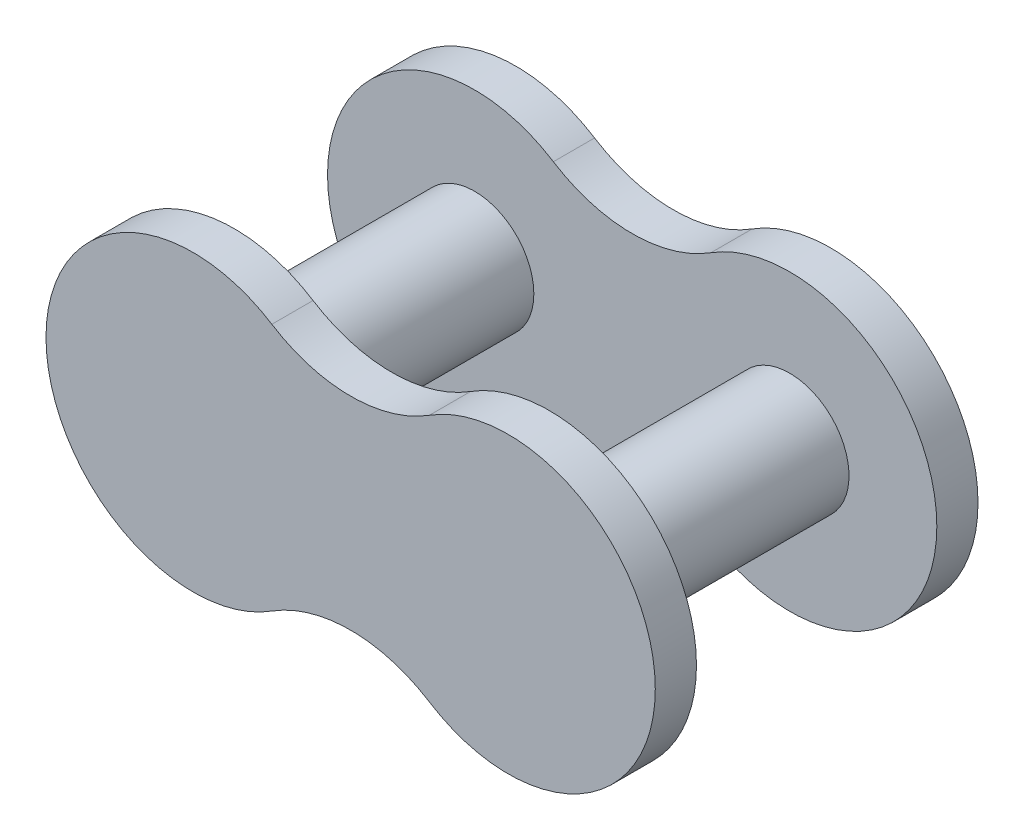
ISO-10303-21;
HEADER;
FILE_DESCRIPTION(('STEP AP214'),'2;1');
FILE_NAME('part.step','',(''),(''),'','','');
FILE_SCHEMA(('AUTOMOTIVE_DESIGN { 1 0 10303 214 1 1 1 1 }'));
ENDSEC;
DATA;
#1=APPLICATION_CONTEXT('core data for automotive mechanical design processes');
#2=APPLICATION_PROTOCOL_DEFINITION('international standard','automotive_design',2000,#1);
#3=PRODUCT_CONTEXT('',#1,'mechanical');
#4=PRODUCT('Part','Part','',(#3));
#5=PRODUCT_RELATED_PRODUCT_CATEGORY('part','',(#4));
#6=PRODUCT_DEFINITION_FORMATION('','',#4);
#7=PRODUCT_DEFINITION_CONTEXT('part definition',#1,'design');
#8=PRODUCT_DEFINITION('design','',#6,#7);
#9=PRODUCT_DEFINITION_SHAPE('','',#8);
#10=(LENGTH_UNIT() NAMED_UNIT(*) SI_UNIT(.MILLI.,.METRE.));
#11=(NAMED_UNIT(*) PLANE_ANGLE_UNIT() SI_UNIT($,.RADIAN.));
#12=(NAMED_UNIT(*) SI_UNIT($,.STERADIAN.) SOLID_ANGLE_UNIT());
#13=UNCERTAINTY_MEASURE_WITH_UNIT(LENGTH_MEASURE(1.E-05),#10,'distance_accuracy_value','');
#14=(GEOMETRIC_REPRESENTATION_CONTEXT(3) GLOBAL_UNCERTAINTY_ASSIGNED_CONTEXT((#13)) GLOBAL_UNIT_ASSIGNED_CONTEXT((#10,
#11,#12)) REPRESENTATION_CONTEXT('',''));
#15=CARTESIAN_POINT('',(0.,0.,0.));
#16=DIRECTION('',(0.,0.,1.));
#17=DIRECTION('',(1.,0.,0.));
#18=AXIS2_PLACEMENT_3D('',#15,#16,#17);
#19=CARTESIAN_POINT('',(-4.7625,0.,3.6322));
#20=DIRECTION('',(0.,0.,-1.));
#21=DIRECTION('',(-1.,0.,0.));
#22=AXIS2_PLACEMENT_3D('',#19,#20,#21);
#23=CYLINDRICAL_SURFACE('',#22,1.7907);
#24=CARTESIAN_POINT('',(-4.7625,0.,3.6322));
#25=DIRECTION('',(0.,0.,1.));
#26=DIRECTION('',(1.,0.,0.));
#27=AXIS2_PLACEMENT_3D('',#24,#25,#26);
#28=CIRCLE('',#27,1.7907);
#29=CARTESIAN_POINT('',(-2.9718,0.,3.6322));
#30=VERTEX_POINT('',#29);
#31=EDGE_CURVE('E50',#30,#30,#28,.T.);
#32=ORIENTED_EDGE('',*,*,#31,.F.);
#33=EDGE_LOOP('',(#32));
#34=FACE_BOUND('',#33,.T.);
#35=CARTESIAN_POINT('',(-4.7625,0.,-3.6322));
#36=DIRECTION('',(0.,0.,1.));
#37=DIRECTION('',(1.,0.,0.));
#38=AXIS2_PLACEMENT_3D('',#35,#36,#37);
#39=CIRCLE('',#38,1.7907);
#40=CARTESIAN_POINT('',(-2.9718,0.,-3.6322));
#41=VERTEX_POINT('',#40);
#42=EDGE_CURVE('E162',#41,#41,#39,.T.);
#43=ORIENTED_EDGE('',*,*,#42,.T.);
#44=EDGE_LOOP('',(#43));
#45=FACE_BOUND('',#44,.T.);
#46=ADVANCED_FACE('F42',(#34,#45),#23,.T.);
#47=CARTESIAN_POINT('',(0.,7.50670991513592,4.8768));
#48=DIRECTION('',(0.,0.,-1.));
#49=DIRECTION('',(-1.,0.,0.));
#50=AXIS2_PLACEMENT_3D('',#47,#48,#49);
#51=CYLINDRICAL_SURFACE('',#50,4.445);
#52=CARTESIAN_POINT('',(0.,7.50670991513592,3.6322));
#53=DIRECTION('',(0.,0.,-1.));
#54=DIRECTION('',(1.,0.,0.));
#55=AXIS2_PLACEMENT_3D('',#52,#53,#54);
#56=CIRCLE('',#55,4.445);
#57=CARTESIAN_POINT('',(2.38125,3.75335495756796,3.6322));
#58=VERTEX_POINT('',#57);
#59=CARTESIAN_POINT('',(-2.38125,3.75335495756796,3.6322));
#60=VERTEX_POINT('',#59);
#61=EDGE_CURVE('E170',#58,#60,#56,.T.);
#62=ORIENTED_EDGE('',*,*,#61,.T.);
#63=DIRECTION('',(0.,0.,-1.));
#64=VECTOR('',#63,1.);
#65=CARTESIAN_POINT('',(-2.38125,3.75335495756796,4.8768));
#66=LINE('',#65,#64);
#67=CARTESIAN_POINT('',(-2.38125,3.75335495756796,4.8768));
#68=VERTEX_POINT('',#67);
#69=EDGE_CURVE('E182',#68,#60,#66,.T.);
#70=ORIENTED_EDGE('',*,*,#69,.F.);
#71=CARTESIAN_POINT('',(0.,7.50670991513592,4.8768));
#72=DIRECTION('',(0.,0.,-1.));
#73=DIRECTION('',(1.,0.,0.));
#74=AXIS2_PLACEMENT_3D('',#71,#72,#73);
#75=CIRCLE('',#74,4.445);
#76=CARTESIAN_POINT('',(2.38125,3.75335495756796,4.8768));
#77=VERTEX_POINT('',#76);
#78=EDGE_CURVE('E163',#77,#68,#75,.T.);
#79=ORIENTED_EDGE('',*,*,#78,.F.);
#80=DIRECTION('',(0.,0.,-1.));
#81=VECTOR('',#80,1.);
#82=CARTESIAN_POINT('',(2.38125,3.75335495756796,4.8768));
#83=LINE('',#82,#81);
#84=EDGE_CURVE('E169',#77,#58,#83,.T.);
#85=ORIENTED_EDGE('',*,*,#84,.T.);
#86=EDGE_LOOP('',(#62,#70,#79,#85));
#87=FACE_BOUND('',#86,.T.);
#88=ADVANCED_FACE('F210',(#87),#51,.F.);
#89=CARTESIAN_POINT('',(-4.7625,0.,4.8768));
#90=DIRECTION('',(0.,0.,-1.));
#91=DIRECTION('',(-1.,0.,0.));
#92=AXIS2_PLACEMENT_3D('',#89,#90,#91);
#93=CYLINDRICAL_SURFACE('',#92,4.445);
#94=CARTESIAN_POINT('',(-4.7625,0.,3.6322));
#95=DIRECTION('',(0.,0.,1.));
#96=DIRECTION('',(1.,0.,0.));
#97=AXIS2_PLACEMENT_3D('',#94,#95,#96);
#98=CIRCLE('',#97,4.445);
#99=CARTESIAN_POINT('',(-2.38125,-3.75335495756796,3.6322));
#100=VERTEX_POINT('',#99);
#101=EDGE_CURVE('E173',#60,#100,#98,.T.);
#102=ORIENTED_EDGE('',*,*,#101,.T.);
#103=DIRECTION('',(0.,0.,-1.));
#104=VECTOR('',#103,1.);
#105=CARTESIAN_POINT('',(-2.38125,-3.75335495756796,4.8768));
#106=LINE('',#105,#104);
#107=CARTESIAN_POINT('',(-2.38125,-3.75335495756796,4.8768));
#108=VERTEX_POINT('',#107);
#109=EDGE_CURVE('E180',#108,#100,#106,.T.);
#110=ORIENTED_EDGE('',*,*,#109,.F.);
#111=CARTESIAN_POINT('',(-4.7625,0.,4.8768));
#112=DIRECTION('',(0.,0.,1.));
#113=DIRECTION('',(1.,0.,0.));
#114=AXIS2_PLACEMENT_3D('',#111,#112,#113);
#115=CIRCLE('',#114,4.445);
#116=EDGE_CURVE('E90',#68,#108,#115,.T.);
#117=ORIENTED_EDGE('',*,*,#116,.F.);
#118=ORIENTED_EDGE('',*,*,#69,.T.);
#119=EDGE_LOOP('',(#102,#110,#117,#118));
#120=FACE_BOUND('',#119,.T.);
#121=ADVANCED_FACE('F215',(#120),#93,.T.);
#122=CARTESIAN_POINT('',(0.,-7.50670991513592,4.8768));
#123=DIRECTION('',(0.,0.,-1.));
#124=DIRECTION('',(-1.,0.,0.));
#125=AXIS2_PLACEMENT_3D('',#122,#123,#124);
#126=CYLINDRICAL_SURFACE('',#125,4.445);
#127=CARTESIAN_POINT('',(0.,-7.50670991513592,3.6322));
#128=DIRECTION('',(0.,0.,-1.));
#129=DIRECTION('',(-1.,0.,0.));
#130=AXIS2_PLACEMENT_3D('',#127,#128,#129);
#131=CIRCLE('',#130,4.445);
#132=CARTESIAN_POINT('',(2.38125,-3.75335495756796,3.6322));
#133=VERTEX_POINT('',#132);
#134=EDGE_CURVE('E76',#100,#133,#131,.T.);
#135=ORIENTED_EDGE('',*,*,#134,.T.);
#136=DIRECTION('',(0.,0.,-1.));
#137=VECTOR('',#136,1.);
#138=CARTESIAN_POINT('',(2.38125,-3.75335495756796,4.8768));
#139=LINE('',#138,#137);
#140=CARTESIAN_POINT('',(2.38125,-3.75335495756796,4.8768));
#141=VERTEX_POINT('',#140);
#142=EDGE_CURVE('E178',#141,#133,#139,.T.);
#143=ORIENTED_EDGE('',*,*,#142,.F.);
#144=CARTESIAN_POINT('',(0.,-7.50670991513592,4.8768));
#145=DIRECTION('',(0.,0.,-1.));
#146=DIRECTION('',(-1.,0.,0.));
#147=AXIS2_PLACEMENT_3D('',#144,#145,#146);
#148=CIRCLE('',#147,4.445);
#149=EDGE_CURVE('E166',#108,#141,#148,.T.);
#150=ORIENTED_EDGE('',*,*,#149,.F.);
#151=ORIENTED_EDGE('',*,*,#109,.T.);
#152=EDGE_LOOP('',(#135,#143,#150,#151));
#153=FACE_BOUND('',#152,.T.);
#154=ADVANCED_FACE('F231',(#153),#126,.F.);
#155=CARTESIAN_POINT('',(4.7625,0.,4.8768));
#156=DIRECTION('',(0.,0.,-1.));
#157=DIRECTION('',(-1.,0.,0.));
#158=AXIS2_PLACEMENT_3D('',#155,#156,#157);
#159=CYLINDRICAL_SURFACE('',#158,4.445);
#160=CARTESIAN_POINT('',(4.7625,0.,3.6322));
#161=DIRECTION('',(0.,0.,1.));
#162=DIRECTION('',(-1.,0.,0.));
#163=AXIS2_PLACEMENT_3D('',#160,#161,#162);
#164=CIRCLE('',#163,4.445);
#165=EDGE_CURVE('E82',#133,#58,#164,.T.);
#166=ORIENTED_EDGE('',*,*,#165,.T.);
#167=ORIENTED_EDGE('',*,*,#84,.F.);
#168=CARTESIAN_POINT('',(4.7625,0.,4.8768));
#169=DIRECTION('',(0.,0.,1.));
#170=DIRECTION('',(-1.,0.,0.));
#171=AXIS2_PLACEMENT_3D('',#168,#169,#170);
#172=CIRCLE('',#171,4.445);
#173=EDGE_CURVE('E58',#141,#77,#172,.T.);
#174=ORIENTED_EDGE('',*,*,#173,.F.);
#175=ORIENTED_EDGE('',*,*,#142,.T.);
#176=EDGE_LOOP('',(#166,#167,#174,#175));
#177=FACE_BOUND('',#176,.T.);
#178=ADVANCED_FACE('F229',(#177),#159,.T.);
#179=CARTESIAN_POINT('',(2.38125,3.75335495756796,4.8768));
#180=DIRECTION('',(0.,0.,1.));
#181=DIRECTION('',(1.,0.,0.));
#182=AXIS2_PLACEMENT_3D('',#179,#180,#181);
#183=PLANE('',#182);
#184=ORIENTED_EDGE('',*,*,#78,.T.);
#185=ORIENTED_EDGE('',*,*,#116,.T.);
#186=ORIENTED_EDGE('',*,*,#149,.T.);
#187=ORIENTED_EDGE('',*,*,#173,.T.);
#188=EDGE_LOOP('',(#184,#185,#186,#187));
#189=FACE_BOUND('',#188,.T.);
#190=ADVANCED_FACE('F223',(#189),#183,.T.);
#191=CARTESIAN_POINT('',(2.38125,3.75335495756796,3.6322));
#192=DIRECTION('',(0.,0.,1.));
#193=DIRECTION('',(1.,0.,0.));
#194=AXIS2_PLACEMENT_3D('',#191,#192,#193);
#195=PLANE('',#194);
#196=CARTESIAN_POINT('',(4.7625,0.,3.6322));
#197=DIRECTION('',(0.,0.,1.));
#198=DIRECTION('',(1.,0.,0.));
#199=AXIS2_PLACEMENT_3D('',#196,#197,#198);
#200=CIRCLE('',#199,1.7907);
#201=CARTESIAN_POINT('',(6.5532,0.,3.6322));
#202=VERTEX_POINT('',#201);
#203=EDGE_CURVE('E11',#202,#202,#200,.F.);
#204=ORIENTED_EDGE('',*,*,#203,.F.);
#205=EDGE_LOOP('',(#204));
#206=FACE_BOUND('',#205,.T.);
#207=ORIENTED_EDGE('',*,*,#31,.T.);
#208=EDGE_LOOP('',(#207));
#209=FACE_BOUND('',#208,.T.);
#210=ORIENTED_EDGE('',*,*,#61,.F.);
#211=ORIENTED_EDGE('',*,*,#165,.F.);
#212=ORIENTED_EDGE('',*,*,#134,.F.);
#213=ORIENTED_EDGE('',*,*,#101,.F.);
#214=EDGE_LOOP('',(#210,#211,#212,#213));
#215=FACE_BOUND('',#214,.T.);
#216=ADVANCED_FACE('F219',(#206,#209,#215),#195,.F.);
#217=CARTESIAN_POINT('',(4.7625,0.,3.6322));
#218=DIRECTION('',(0.,0.,-1.));
#219=DIRECTION('',(-1.,0.,0.));
#220=AXIS2_PLACEMENT_3D('',#217,#218,#219);
#221=CYLINDRICAL_SURFACE('',#220,1.7907);
#222=ORIENTED_EDGE('',*,*,#203,.T.);
#223=EDGE_LOOP('',(#222));
#224=FACE_BOUND('',#223,.T.);
#225=CARTESIAN_POINT('',(4.7625,0.,-3.6322));
#226=DIRECTION('',(0.,0.,1.));
#227=DIRECTION('',(-1.,0.,0.));
#228=AXIS2_PLACEMENT_3D('',#225,#226,#227);
#229=CIRCLE('',#228,1.7907);
#230=CARTESIAN_POINT('',(2.9718,0.,-3.6322));
#231=VERTEX_POINT('',#230);
#232=EDGE_CURVE('E128',#231,#231,#229,.T.);
#233=ORIENTED_EDGE('',*,*,#232,.T.);
#234=EDGE_LOOP('',(#233));
#235=FACE_BOUND('',#234,.T.);
#236=ADVANCED_FACE('F222',(#224,#235),#221,.T.);
#237=CARTESIAN_POINT('',(0.,7.50670991513592,-4.8768));
#238=DIRECTION('',(0.,0.,1.));
#239=DIRECTION('',(1.,0.,0.));
#240=AXIS2_PLACEMENT_3D('',#237,#238,#239);
#241=CYLINDRICAL_SURFACE('',#240,4.445);
#242=CARTESIAN_POINT('',(0.,7.50670991513592,-3.6322));
#243=DIRECTION('',(0.,0.,-1.));
#244=DIRECTION('',(1.,0.,0.));
#245=AXIS2_PLACEMENT_3D('',#242,#243,#244);
#246=CIRCLE('',#245,4.445);
#247=CARTESIAN_POINT('',(2.38125,3.75335495756796,-3.6322));
#248=VERTEX_POINT('',#247);
#249=CARTESIAN_POINT('',(-2.38125,3.75335495756796,-3.6322));
#250=VERTEX_POINT('',#249);
#251=EDGE_CURVE('E123',#248,#250,#246,.T.);
#252=ORIENTED_EDGE('',*,*,#251,.F.);
#253=DIRECTION('',(0.,0.,1.));
#254=VECTOR('',#253,1.);
#255=CARTESIAN_POINT('',(2.38125,3.75335495756796,-4.8768));
#256=LINE('',#255,#254);
#257=CARTESIAN_POINT('',(2.38125,3.75335495756796,-4.8768));
#258=VERTEX_POINT('',#257);
#259=EDGE_CURVE('E117',#258,#248,#256,.T.);
#260=ORIENTED_EDGE('',*,*,#259,.F.);
#261=CARTESIAN_POINT('',(0.,7.50670991513592,-4.8768));
#262=DIRECTION('',(0.,0.,-1.));
#263=DIRECTION('',(1.,0.,0.));
#264=AXIS2_PLACEMENT_3D('',#261,#262,#263);
#265=CIRCLE('',#264,4.445);
#266=CARTESIAN_POINT('',(-2.38125,3.75335495756796,-4.8768));
#267=VERTEX_POINT('',#266);
#268=EDGE_CURVE('E120',#258,#267,#265,.T.);
#269=ORIENTED_EDGE('',*,*,#268,.T.);
#270=DIRECTION('',(0.,0.,1.));
#271=VECTOR('',#270,1.);
#272=CARTESIAN_POINT('',(-2.38125,3.75335495756796,-4.8768));
#273=LINE('',#272,#271);
#274=EDGE_CURVE('E147',#267,#250,#273,.T.);
#275=ORIENTED_EDGE('',*,*,#274,.T.);
#276=EDGE_LOOP('',(#252,#260,#269,#275));
#277=FACE_BOUND('',#276,.T.);
#278=ADVANCED_FACE('F119',(#277),#241,.F.);
#279=CARTESIAN_POINT('',(4.7625,0.,-4.8768));
#280=DIRECTION('',(0.,0.,1.));
#281=DIRECTION('',(1.,0.,0.));
#282=AXIS2_PLACEMENT_3D('',#279,#280,#281);
#283=CYLINDRICAL_SURFACE('',#282,4.445);
#284=CARTESIAN_POINT('',(4.7625,0.,-3.6322));
#285=DIRECTION('',(0.,0.,1.));
#286=DIRECTION('',(-1.,0.,0.));
#287=AXIS2_PLACEMENT_3D('',#284,#285,#286);
#288=CIRCLE('',#287,4.445);
#289=CARTESIAN_POINT('',(2.38125,-3.75335495756796,-3.6322));
#290=VERTEX_POINT('',#289);
#291=EDGE_CURVE('E149',#290,#248,#288,.T.);
#292=ORIENTED_EDGE('',*,*,#291,.F.);
#293=DIRECTION('',(0.,0.,1.));
#294=VECTOR('',#293,1.);
#295=CARTESIAN_POINT('',(2.38125,-3.75335495756796,-4.8768));
#296=LINE('',#295,#294);
#297=CARTESIAN_POINT('',(2.38125,-3.75335495756796,-4.8768));
#298=VERTEX_POINT('',#297);
#299=EDGE_CURVE('E129',#298,#290,#296,.T.);
#300=ORIENTED_EDGE('',*,*,#299,.F.);
#301=CARTESIAN_POINT('',(4.7625,0.,-4.8768));
#302=DIRECTION('',(0.,0.,1.));
#303=DIRECTION('',(-1.,0.,0.));
#304=AXIS2_PLACEMENT_3D('',#301,#302,#303);
#305=CIRCLE('',#304,4.445);
#306=EDGE_CURVE('E135',#298,#258,#305,.T.);
#307=ORIENTED_EDGE('',*,*,#306,.T.);
#308=ORIENTED_EDGE('',*,*,#259,.T.);
#309=EDGE_LOOP('',(#292,#300,#307,#308));
#310=FACE_BOUND('',#309,.T.);
#311=ADVANCED_FACE('F141',(#310),#283,.T.);
#312=CARTESIAN_POINT('',(0.,-7.50670991513592,-4.8768));
#313=DIRECTION('',(0.,0.,1.));
#314=DIRECTION('',(1.,0.,0.));
#315=AXIS2_PLACEMENT_3D('',#312,#313,#314);
#316=CYLINDRICAL_SURFACE('',#315,4.445);
#317=CARTESIAN_POINT('',(0.,-7.50670991513592,-3.6322));
#318=DIRECTION('',(0.,0.,-1.));
#319=DIRECTION('',(-1.,0.,0.));
#320=AXIS2_PLACEMENT_3D('',#317,#318,#319);
#321=CIRCLE('',#320,4.445);
#322=CARTESIAN_POINT('',(-2.38125,-3.75335495756796,-3.6322));
#323=VERTEX_POINT('',#322);
#324=EDGE_CURVE('E151',#323,#290,#321,.T.);
#325=ORIENTED_EDGE('',*,*,#324,.F.);
#326=DIRECTION('',(0.,0.,1.));
#327=VECTOR('',#326,1.);
#328=CARTESIAN_POINT('',(-2.38125,-3.75335495756796,-4.8768));
#329=LINE('',#328,#327);
#330=CARTESIAN_POINT('',(-2.38125,-3.75335495756796,-4.8768));
#331=VERTEX_POINT('',#330);
#332=EDGE_CURVE('E157',#331,#323,#329,.T.);
#333=ORIENTED_EDGE('',*,*,#332,.F.);
#334=CARTESIAN_POINT('',(0.,-7.50670991513592,-4.8768));
#335=DIRECTION('',(0.,0.,-1.));
#336=DIRECTION('',(-1.,0.,0.));
#337=AXIS2_PLACEMENT_3D('',#334,#335,#336);
#338=CIRCLE('',#337,4.445);
#339=EDGE_CURVE('E142',#331,#298,#338,.T.);
#340=ORIENTED_EDGE('',*,*,#339,.T.);
#341=ORIENTED_EDGE('',*,*,#299,.T.);
#342=EDGE_LOOP('',(#325,#333,#340,#341));
#343=FACE_BOUND('',#342,.T.);
#344=ADVANCED_FACE('F200',(#343),#316,.F.);
#345=CARTESIAN_POINT('',(-4.7625,0.,-4.8768));
#346=DIRECTION('',(0.,0.,1.));
#347=DIRECTION('',(1.,0.,0.));
#348=AXIS2_PLACEMENT_3D('',#345,#346,#347);
#349=CYLINDRICAL_SURFACE('',#348,4.445);
#350=CARTESIAN_POINT('',(-4.7625,0.,-3.6322));
#351=DIRECTION('',(0.,0.,1.));
#352=DIRECTION('',(1.,0.,0.));
#353=AXIS2_PLACEMENT_3D('',#350,#351,#352);
#354=CIRCLE('',#353,4.445);
#355=EDGE_CURVE('E139',#250,#323,#354,.T.);
#356=ORIENTED_EDGE('',*,*,#355,.F.);
#357=ORIENTED_EDGE('',*,*,#274,.F.);
#358=CARTESIAN_POINT('',(-4.7625,0.,-4.8768));
#359=DIRECTION('',(0.,0.,1.));
#360=DIRECTION('',(1.,0.,0.));
#361=AXIS2_PLACEMENT_3D('',#358,#359,#360);
#362=CIRCLE('',#361,4.445);
#363=EDGE_CURVE('E138',#267,#331,#362,.T.);
#364=ORIENTED_EDGE('',*,*,#363,.T.);
#365=ORIENTED_EDGE('',*,*,#332,.T.);
#366=EDGE_LOOP('',(#356,#357,#364,#365));
#367=FACE_BOUND('',#366,.T.);
#368=ADVANCED_FACE('F197',(#367),#349,.T.);
#369=CARTESIAN_POINT('',(2.38125,3.75335495756796,-4.8768));
#370=DIRECTION('',(0.,0.,-1.));
#371=DIRECTION('',(1.,0.,0.));
#372=AXIS2_PLACEMENT_3D('',#369,#370,#371);
#373=PLANE('',#372);
#374=ORIENTED_EDGE('',*,*,#268,.F.);
#375=ORIENTED_EDGE('',*,*,#306,.F.);
#376=ORIENTED_EDGE('',*,*,#339,.F.);
#377=ORIENTED_EDGE('',*,*,#363,.F.);
#378=EDGE_LOOP('',(#374,#375,#376,#377));
#379=FACE_BOUND('',#378,.T.);
#380=ADVANCED_FACE('F133',(#379),#373,.T.);
#381=CARTESIAN_POINT('',(2.38125,3.75335495756796,-3.6322));
#382=DIRECTION('',(0.,0.,-1.));
#383=DIRECTION('',(1.,0.,0.));
#384=AXIS2_PLACEMENT_3D('',#381,#382,#383);
#385=PLANE('',#384);
#386=ORIENTED_EDGE('',*,*,#42,.F.);
#387=EDGE_LOOP('',(#386));
#388=FACE_BOUND('',#387,.T.);
#389=ORIENTED_EDGE('',*,*,#232,.F.);
#390=EDGE_LOOP('',(#389));
#391=FACE_BOUND('',#390,.T.);
#392=ORIENTED_EDGE('',*,*,#251,.T.);
#393=ORIENTED_EDGE('',*,*,#355,.T.);
#394=ORIENTED_EDGE('',*,*,#324,.T.);
#395=ORIENTED_EDGE('',*,*,#291,.T.);
#396=EDGE_LOOP('',(#392,#393,#394,#395));
#397=FACE_BOUND('',#396,.T.);
#398=ADVANCED_FACE('F189',(#388,#391,#397),#385,.F.);
#399=CLOSED_SHELL('',(#46,#88,#121,#154,#178,#190,#216,#236,#278,#311,#344,#368,#380,#398));
#400=MANIFOLD_SOLID_BREP('B2',#399);
#401=ADVANCED_BREP_SHAPE_REPRESENTATION('',(#18,#400),#14);
#402=SHAPE_DEFINITION_REPRESENTATION(#9,#401);
ENDSEC;
END-ISO-10303-21;
